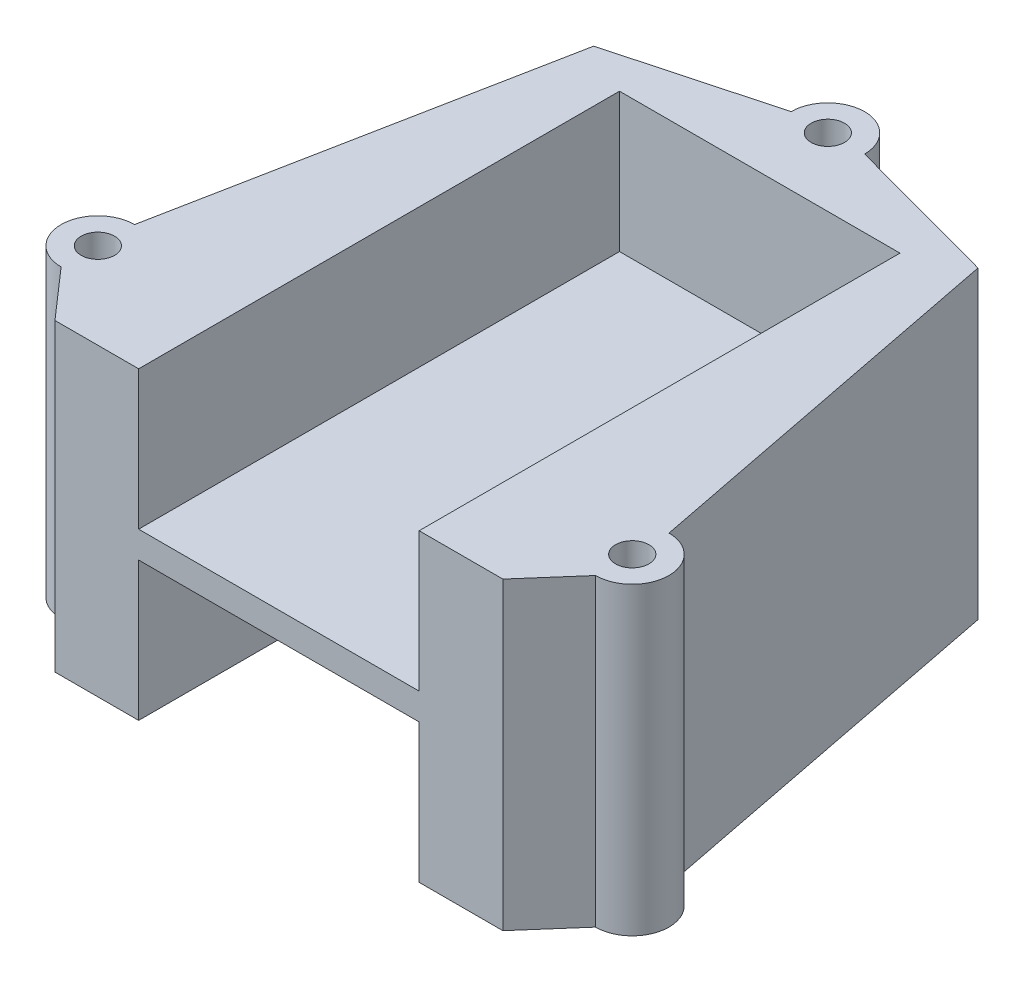
ISO-10303-21;
HEADER;
FILE_DESCRIPTION(('STEP AP214'),'2;1');
FILE_NAME('part.step','',(''),(''),'','','');
FILE_SCHEMA(('AUTOMOTIVE_DESIGN { 1 0 10303 214 1 1 1 1 }'));
ENDSEC;
DATA;
#1=APPLICATION_CONTEXT('core data for automotive mechanical design processes');
#2=APPLICATION_PROTOCOL_DEFINITION('international standard','automotive_design',2000,#1);
#3=PRODUCT_CONTEXT('',#1,'mechanical');
#4=PRODUCT('Part','Part','',(#3));
#5=PRODUCT_RELATED_PRODUCT_CATEGORY('part','',(#4));
#6=PRODUCT_DEFINITION_FORMATION('','',#4);
#7=PRODUCT_DEFINITION_CONTEXT('part definition',#1,'design');
#8=PRODUCT_DEFINITION('design','',#6,#7);
#9=PRODUCT_DEFINITION_SHAPE('','',#8);
#10=(LENGTH_UNIT() NAMED_UNIT(*) SI_UNIT(.MILLI.,.METRE.));
#11=(NAMED_UNIT(*) PLANE_ANGLE_UNIT() SI_UNIT($,.RADIAN.));
#12=(NAMED_UNIT(*) SI_UNIT($,.STERADIAN.) SOLID_ANGLE_UNIT());
#13=UNCERTAINTY_MEASURE_WITH_UNIT(LENGTH_MEASURE(1.E-05),#10,'distance_accuracy_value','');
#14=(GEOMETRIC_REPRESENTATION_CONTEXT(3) GLOBAL_UNCERTAINTY_ASSIGNED_CONTEXT((#13)) GLOBAL_UNIT_ASSIGNED_CONTEXT((#10,
#11,#12)) REPRESENTATION_CONTEXT('',''));
#15=CARTESIAN_POINT('',(0.,0.,0.));
#16=DIRECTION('',(0.,0.,1.));
#17=DIRECTION('',(1.,0.,0.));
#18=AXIS2_PLACEMENT_3D('',#15,#16,#17);
#19=CARTESIAN_POINT('',(7.62756429182967,31.496,-28.2193089615794));
#20=DIRECTION('',(-0.260932107471473,0.,0.965357154264936));
#21=DIRECTION('',(0.965357154264936,0.,0.260932107471473));
#22=AXIS2_PLACEMENT_3D('',#19,#20,#21);
#23=PLANE('',#22);
#24=DIRECTION('',(-0.965357154264936,0.,-0.260932107471473));
#25=VECTOR('',#24,1.);
#26=CARTESIAN_POINT('',(7.62756429182967,2.54,-28.2193089615794));
#27=LINE('',#26,#25);
#28=CARTESIAN_POINT('',(18.2707496641315,2.54,-25.342499298819));
#29=VERTEX_POINT('',#28);
#30=CARTESIAN_POINT('',(3.4925,2.54,-29.337));
#31=VERTEX_POINT('',#30);
#32=EDGE_CURVE('E190',#29,#31,#27,.T.);
#33=ORIENTED_EDGE('',*,*,#32,.T.);
#34=DIRECTION('',(0.,-1.,0.));
#35=VECTOR('',#34,1.);
#36=CARTESIAN_POINT('',(3.4925,31.496,-29.337));
#37=LINE('',#36,#35);
#38=CARTESIAN_POINT('',(3.4925,31.496,-29.337));
#39=VERTEX_POINT('',#38);
#40=EDGE_CURVE('E303',#39,#31,#37,.T.);
#41=ORIENTED_EDGE('',*,*,#40,.F.);
#42=DIRECTION('',(-0.965357154264936,0.,-0.260932107471473));
#43=VECTOR('',#42,1.);
#44=CARTESIAN_POINT('',(7.62756429182967,31.496,-28.2193089615794));
#45=LINE('',#44,#43);
#46=CARTESIAN_POINT('',(18.2707496641315,31.496,-25.342499298819));
#47=VERTEX_POINT('',#46);
#48=EDGE_CURVE('E208',#47,#39,#45,.T.);
#49=ORIENTED_EDGE('',*,*,#48,.F.);
#50=DIRECTION('',(0.,-1.,0.));
#51=VECTOR('',#50,1.);
#52=CARTESIAN_POINT('',(18.2707496641315,31.496,-25.342499298819));
#53=LINE('',#52,#51);
#54=EDGE_CURVE('E246',#47,#29,#53,.T.);
#55=ORIENTED_EDGE('',*,*,#54,.T.);
#56=EDGE_LOOP('',(#33,#41,#49,#55));
#57=FACE_BOUND('',#56,.T.);
#58=ADVANCED_FACE('F37',(#57),#23,.F.);
#59=CARTESIAN_POINT('',(0.,31.496,-29.337));
#60=DIRECTION('',(0.,-1.,0.));
#61=DIRECTION('',(0.,0.,-1.));
#62=AXIS2_PLACEMENT_3D('',#59,#60,#61);
#63=CYLINDRICAL_SURFACE('',#62,3.4925);
#64=CARTESIAN_POINT('',(0.,2.54,-29.337));
#65=DIRECTION('',(0.,1.,0.));
#66=DIRECTION('',(0.,0.,1.));
#67=AXIS2_PLACEMENT_3D('',#64,#65,#66);
#68=CIRCLE('',#67,3.4925);
#69=CARTESIAN_POINT('',(-3.4925,2.54,-29.337));
#70=VERTEX_POINT('',#69);
#71=EDGE_CURVE('E249',#31,#70,#68,.T.);
#72=ORIENTED_EDGE('',*,*,#71,.T.);
#73=DIRECTION('',(0.,-1.,0.));
#74=VECTOR('',#73,1.);
#75=CARTESIAN_POINT('',(-3.4925,31.496,-29.337));
#76=LINE('',#75,#74);
#77=CARTESIAN_POINT('',(-3.4925,31.496,-29.337));
#78=VERTEX_POINT('',#77);
#79=EDGE_CURVE('E301',#78,#70,#76,.T.);
#80=ORIENTED_EDGE('',*,*,#79,.F.);
#81=CARTESIAN_POINT('',(0.,31.496,-29.337));
#82=DIRECTION('',(0.,1.,0.));
#83=DIRECTION('',(0.,0.,1.));
#84=AXIS2_PLACEMENT_3D('',#81,#82,#83);
#85=CIRCLE('',#84,3.4925);
#86=EDGE_CURVE('E211',#39,#78,#85,.T.);
#87=ORIENTED_EDGE('',*,*,#86,.F.);
#88=ORIENTED_EDGE('',*,*,#40,.T.);
#89=EDGE_LOOP('',(#72,#80,#87,#88));
#90=FACE_BOUND('',#89,.T.);
#91=ADVANCED_FACE('F368',(#90),#63,.T.);
#92=CARTESIAN_POINT('',(-7.62756429182967,31.496,-28.2193089615794));
#93=DIRECTION('',(-0.260932107471473,0.,-0.965357154264936));
#94=DIRECTION('',(-0.965357154264936,0.,0.260932107471473));
#95=AXIS2_PLACEMENT_3D('',#92,#93,#94);
#96=PLANE('',#95);
#97=DIRECTION('',(0.965357154264936,0.,-0.260932107471473));
#98=VECTOR('',#97,1.);
#99=CARTESIAN_POINT('',(-7.62756429182967,2.54,-28.2193089615794));
#100=LINE('',#99,#98);
#101=CARTESIAN_POINT('',(-18.2707496641315,2.54,-25.342499298819));
#102=VERTEX_POINT('',#101);
#103=EDGE_CURVE('E252',#102,#70,#100,.T.);
#104=ORIENTED_EDGE('',*,*,#103,.F.);
#105=DIRECTION('',(0.,-1.,0.));
#106=VECTOR('',#105,1.);
#107=CARTESIAN_POINT('',(-18.2707496641315,31.496,-25.342499298819));
#108=LINE('',#107,#106);
#109=CARTESIAN_POINT('',(-18.2707496641315,31.496,-25.342499298819));
#110=VERTEX_POINT('',#109);
#111=EDGE_CURVE('E299',#110,#102,#108,.T.);
#112=ORIENTED_EDGE('',*,*,#111,.F.);
#113=DIRECTION('',(0.965357154264936,0.,-0.260932107471473));
#114=VECTOR('',#113,1.);
#115=CARTESIAN_POINT('',(-7.62756429182967,31.496,-28.2193089615794));
#116=LINE('',#115,#114);
#117=EDGE_CURVE('E214',#110,#78,#116,.T.);
#118=ORIENTED_EDGE('',*,*,#117,.T.);
#119=ORIENTED_EDGE('',*,*,#79,.T.);
#120=EDGE_LOOP('',(#104,#112,#118,#119));
#121=FACE_BOUND('',#120,.T.);
#122=ADVANCED_FACE('F373',(#121),#96,.T.);
#123=CARTESIAN_POINT('',(-22.368668171537,31.496,-4.37091300614584));
#124=DIRECTION('',(-0.981438641880801,0.,-0.191776412061467));
#125=DIRECTION('',(-0.191776412061467,0.,0.981438641880801));
#126=AXIS2_PLACEMENT_3D('',#123,#124,#125);
#127=PLANE('',#126);
#128=DIRECTION('',(0.191776412061467,0.,-0.981438641880801));
#129=VECTOR('',#128,1.);
#130=CARTESIAN_POINT('',(-22.368668171537,2.54,-4.37091300614584));
#131=LINE('',#130,#129);
#132=CARTESIAN_POINT('',(-25.4065872708259,2.54,11.1759999999973));
#133=VERTEX_POINT('',#132);
#134=EDGE_CURVE('E255',#133,#102,#131,.T.);
#135=ORIENTED_EDGE('',*,*,#134,.F.);
#136=DIRECTION('',(0.,-1.,0.));
#137=VECTOR('',#136,1.);
#138=CARTESIAN_POINT('',(-25.4065872708259,31.496,11.1759999999973));
#139=LINE('',#138,#137);
#140=CARTESIAN_POINT('',(-25.4065872708259,31.496,11.1759999999973));
#141=VERTEX_POINT('',#140);
#142=EDGE_CURVE('E297',#141,#133,#139,.T.);
#143=ORIENTED_EDGE('',*,*,#142,.F.);
#144=DIRECTION('',(0.191776412061467,0.,-0.981438641880801));
#145=VECTOR('',#144,1.);
#146=CARTESIAN_POINT('',(-22.368668171537,31.496,-4.37091300614584));
#147=LINE('',#146,#145);
#148=EDGE_CURVE('E217',#141,#110,#147,.T.);
#149=ORIENTED_EDGE('',*,*,#148,.T.);
#150=ORIENTED_EDGE('',*,*,#111,.T.);
#151=EDGE_LOOP('',(#135,#143,#149,#150));
#152=FACE_BOUND('',#151,.T.);
#153=ADVANCED_FACE('F409',(#152),#127,.T.);
#154=CARTESIAN_POINT('',(-25.4065872708259,31.496,14.6684999999989));
#155=DIRECTION('',(0.,-1.,0.));
#156=DIRECTION('',(0.,0.,-1.));
#157=AXIS2_PLACEMENT_3D('',#154,#155,#156);
#158=CYLINDRICAL_SURFACE('',#157,3.49250000000161);
#159=CARTESIAN_POINT('',(-25.4065872708259,2.54,14.6684999999989));
#160=DIRECTION('',(0.,1.,0.));
#161=DIRECTION('',(0.,0.,1.));
#162=AXIS2_PLACEMENT_3D('',#159,#160,#161);
#163=CIRCLE('',#162,3.49250000000161);
#164=CARTESIAN_POINT('',(-25.406587270826,2.54,18.1610000000005));
#165=VERTEX_POINT('',#164);
#166=EDGE_CURVE('E258',#165,#133,#163,.F.);
#167=ORIENTED_EDGE('',*,*,#166,.F.);
#168=DIRECTION('',(0.,-1.,0.));
#169=VECTOR('',#168,1.);
#170=CARTESIAN_POINT('',(-25.406587270826,31.496,18.1610000000005));
#171=LINE('',#170,#169);
#172=CARTESIAN_POINT('',(-25.406587270826,31.496,18.1610000000005));
#173=VERTEX_POINT('',#172);
#174=EDGE_CURVE('E295',#173,#165,#171,.T.);
#175=ORIENTED_EDGE('',*,*,#174,.F.);
#176=CARTESIAN_POINT('',(-25.4065872708259,31.496,14.6684999999989));
#177=DIRECTION('',(0.,1.,0.));
#178=DIRECTION('',(0.,0.,1.));
#179=AXIS2_PLACEMENT_3D('',#176,#177,#178);
#180=CIRCLE('',#179,3.49250000000161);
#181=EDGE_CURVE('E220',#173,#141,#180,.F.);
#182=ORIENTED_EDGE('',*,*,#181,.T.);
#183=ORIENTED_EDGE('',*,*,#142,.T.);
#184=EDGE_LOOP('',(#167,#175,#182,#183));
#185=FACE_BOUND('',#184,.T.);
#186=ADVANCED_FACE('F406',(#185),#158,.T.);
#187=CARTESIAN_POINT('',(-23.3901994162581,31.496,20.4655425677233));
#188=DIRECTION('',(0.752590757097938,0.,-0.658488536218173));
#189=DIRECTION('',(-0.658488536218173,0.,-0.752590757097938));
#190=AXIS2_PLACEMENT_3D('',#187,#188,#189);
#191=PLANE('',#190);
#192=DIRECTION('',(0.658488536218173,0.,0.752590757097938));
#193=VECTOR('',#192,1.);
#194=CARTESIAN_POINT('',(-23.3901994162581,2.54,20.4655425677233));
#195=LINE('',#194,#193);
#196=CARTESIAN_POINT('',(-21.2951394454227,2.54,22.86));
#197=VERTEX_POINT('',#196);
#198=EDGE_CURVE('E261',#165,#197,#195,.T.);
#199=ORIENTED_EDGE('',*,*,#198,.T.);
#200=DIRECTION('',(0.,-1.,0.));
#201=VECTOR('',#200,1.);
#202=CARTESIAN_POINT('',(-21.2951394454227,31.496,22.86));
#203=LINE('',#202,#201);
#204=CARTESIAN_POINT('',(-21.2951394454227,31.496,22.86));
#205=VERTEX_POINT('',#204);
#206=EDGE_CURVE('E292',#205,#197,#203,.T.);
#207=ORIENTED_EDGE('',*,*,#206,.F.);
#208=DIRECTION('',(0.658488536218173,0.,0.752590757097938));
#209=VECTOR('',#208,1.);
#210=CARTESIAN_POINT('',(-23.3901994162581,31.496,20.4655425677233));
#211=LINE('',#210,#209);
#212=EDGE_CURVE('E223',#173,#205,#211,.T.);
#213=ORIENTED_EDGE('',*,*,#212,.F.);
#214=ORIENTED_EDGE('',*,*,#174,.T.);
#215=EDGE_LOOP('',(#199,#207,#213,#214));
#216=FACE_BOUND('',#215,.T.);
#217=ADVANCED_FACE('F328',(#216),#191,.F.);
#218=CARTESIAN_POINT('',(0.,31.496,22.86));
#219=DIRECTION('',(0.,0.,1.));
#220=DIRECTION('',(1.,0.,0.));
#221=AXIS2_PLACEMENT_3D('',#218,#219,#220);
#222=PLANE('',#221);
#223=DIRECTION('',(0.,1.,0.));
#224=VECTOR('',#223,1.);
#225=CARTESIAN_POINT('',(13.335,36.068,22.86));
#226=LINE('',#225,#224);
#227=CARTESIAN_POINT('',(13.335,18.288,22.86));
#228=VERTEX_POINT('',#227);
#229=CARTESIAN_POINT('',(13.335,31.496,22.86));
#230=VERTEX_POINT('',#229);
#231=EDGE_CURVE('E184',#228,#230,#226,.T.);
#232=ORIENTED_EDGE('',*,*,#231,.F.);
#233=DIRECTION('',(1.,0.,0.));
#234=VECTOR('',#233,1.);
#235=CARTESIAN_POINT('',(13.335,18.288,22.86));
#236=LINE('',#235,#234);
#237=CARTESIAN_POINT('',(-13.335,18.288,22.86));
#238=VERTEX_POINT('',#237);
#239=EDGE_CURVE('E188',#238,#228,#236,.T.);
#240=ORIENTED_EDGE('',*,*,#239,.F.);
#241=DIRECTION('',(0.,-1.,0.));
#242=VECTOR('',#241,1.);
#243=CARTESIAN_POINT('',(-13.335,36.068,22.86));
#244=LINE('',#243,#242);
#245=CARTESIAN_POINT('',(-13.335,31.496,22.86));
#246=VERTEX_POINT('',#245);
#247=EDGE_CURVE('E174',#246,#238,#244,.T.);
#248=ORIENTED_EDGE('',*,*,#247,.F.);
#249=DIRECTION('',(-1.,0.,0.));
#250=VECTOR('',#249,1.);
#251=CARTESIAN_POINT('',(0.,31.496,22.86));
#252=LINE('',#251,#250);
#253=EDGE_CURVE('E226',#246,#205,#252,.T.);
#254=ORIENTED_EDGE('',*,*,#253,.T.);
#255=ORIENTED_EDGE('',*,*,#206,.T.);
#256=DIRECTION('',(-1.,0.,0.));
#257=VECTOR('',#256,1.);
#258=CARTESIAN_POINT('',(0.,2.54,22.86));
#259=LINE('',#258,#257);
#260=CARTESIAN_POINT('',(-13.335,2.54,22.86));
#261=VERTEX_POINT('',#260);
#262=EDGE_CURVE('E264',#261,#197,#259,.T.);
#263=ORIENTED_EDGE('',*,*,#262,.F.);
#264=DIRECTION('',(0.,-1.,0.));
#265=VECTOR('',#264,1.);
#266=CARTESIAN_POINT('',(-13.335,-2.032,22.86));
#267=LINE('',#266,#265);
#268=CARTESIAN_POINT('',(-13.335,15.748,22.86));
#269=VERTEX_POINT('',#268);
#270=EDGE_CURVE('E195',#269,#261,#267,.T.);
#271=ORIENTED_EDGE('',*,*,#270,.F.);
#272=DIRECTION('',(-1.,0.,0.));
#273=VECTOR('',#272,1.);
#274=CARTESIAN_POINT('',(13.335,15.748,22.86));
#275=LINE('',#274,#273);
#276=CARTESIAN_POINT('',(13.335,15.748,22.86));
#277=VERTEX_POINT('',#276);
#278=EDGE_CURVE('E201',#277,#269,#275,.T.);
#279=ORIENTED_EDGE('',*,*,#278,.F.);
#280=DIRECTION('',(0.,1.,0.));
#281=VECTOR('',#280,1.);
#282=CARTESIAN_POINT('',(13.335,-2.032,22.86));
#283=LINE('',#282,#281);
#284=CARTESIAN_POINT('',(13.335,2.54,22.86));
#285=VERTEX_POINT('',#284);
#286=EDGE_CURVE('E199',#285,#277,#283,.T.);
#287=ORIENTED_EDGE('',*,*,#286,.F.);
#288=CARTESIAN_POINT('',(21.2951394454227,2.54,22.86));
#289=VERTEX_POINT('',#288);
#290=EDGE_CURVE('E265',#289,#285,#259,.T.);
#291=ORIENTED_EDGE('',*,*,#290,.F.);
#292=DIRECTION('',(0.,-1.,0.));
#293=VECTOR('',#292,1.);
#294=CARTESIAN_POINT('',(21.2951394454227,31.496,22.86));
#295=LINE('',#294,#293);
#296=CARTESIAN_POINT('',(21.2951394454227,31.496,22.86));
#297=VERTEX_POINT('',#296);
#298=EDGE_CURVE('E290',#297,#289,#295,.T.);
#299=ORIENTED_EDGE('',*,*,#298,.F.);
#300=EDGE_CURVE('E227',#297,#230,#252,.T.);
#301=ORIENTED_EDGE('',*,*,#300,.T.);
#302=EDGE_LOOP('',(#232,#240,#248,#254,#255,#263,#271,#279,#287,#291,#299,#301));
#303=FACE_BOUND('',#302,.T.);
#304=ADVANCED_FACE('F319',(#303),#222,.T.);
#305=CARTESIAN_POINT('',(23.3901994162581,31.496,20.4655425677234));
#306=DIRECTION('',(0.752590757097937,0.,0.658488536218175));
#307=DIRECTION('',(0.658488536218175,0.,-0.752590757097937));
#308=AXIS2_PLACEMENT_3D('',#305,#306,#307);
#309=PLANE('',#308);
#310=DIRECTION('',(-0.658488536218175,0.,0.752590757097937));
#311=VECTOR('',#310,1.);
#312=CARTESIAN_POINT('',(23.3901994162581,2.54,20.4655425677234));
#313=LINE('',#312,#311);
#314=CARTESIAN_POINT('',(25.4065872708259,2.54,18.1610000000005));
#315=VERTEX_POINT('',#314);
#316=EDGE_CURVE('E268',#315,#289,#313,.T.);
#317=ORIENTED_EDGE('',*,*,#316,.F.);
#318=DIRECTION('',(0.,-1.,0.));
#319=VECTOR('',#318,1.);
#320=CARTESIAN_POINT('',(25.4065872708259,31.496,18.1610000000005));
#321=LINE('',#320,#319);
#322=CARTESIAN_POINT('',(25.4065872708259,31.496,18.1610000000005));
#323=VERTEX_POINT('',#322);
#324=EDGE_CURVE('E288',#323,#315,#321,.T.);
#325=ORIENTED_EDGE('',*,*,#324,.F.);
#326=DIRECTION('',(-0.658488536218175,0.,0.752590757097937));
#327=VECTOR('',#326,1.);
#328=CARTESIAN_POINT('',(23.3901994162581,31.496,20.4655425677234));
#329=LINE('',#328,#327);
#330=EDGE_CURVE('E230',#323,#297,#329,.T.);
#331=ORIENTED_EDGE('',*,*,#330,.T.);
#332=ORIENTED_EDGE('',*,*,#298,.T.);
#333=EDGE_LOOP('',(#317,#325,#331,#332));
#334=FACE_BOUND('',#333,.T.);
#335=ADVANCED_FACE('F350',(#334),#309,.T.);
#336=CARTESIAN_POINT('',(25.4065872708259,31.496,14.6684999999989));
#337=DIRECTION('',(0.,-1.,0.));
#338=DIRECTION('',(0.,0.,-1.));
#339=AXIS2_PLACEMENT_3D('',#336,#337,#338);
#340=CYLINDRICAL_SURFACE('',#339,3.49250000000161);
#341=CARTESIAN_POINT('',(25.4065872708259,2.54,14.6684999999989));
#342=DIRECTION('',(0.,1.,0.));
#343=DIRECTION('',(0.,0.,1.));
#344=AXIS2_PLACEMENT_3D('',#341,#342,#343);
#345=CIRCLE('',#344,3.49250000000161);
#346=CARTESIAN_POINT('',(25.4065872708259,2.54,11.1759999999973));
#347=VERTEX_POINT('',#346);
#348=EDGE_CURVE('E271',#315,#347,#345,.T.);
#349=ORIENTED_EDGE('',*,*,#348,.T.);
#350=DIRECTION('',(0.,-1.,0.));
#351=VECTOR('',#350,1.);
#352=CARTESIAN_POINT('',(25.4065872708259,31.496,11.1759999999973));
#353=LINE('',#352,#351);
#354=CARTESIAN_POINT('',(25.4065872708259,31.496,11.1759999999973));
#355=VERTEX_POINT('',#354);
#356=EDGE_CURVE('E285',#355,#347,#353,.T.);
#357=ORIENTED_EDGE('',*,*,#356,.F.);
#358=CARTESIAN_POINT('',(25.4065872708259,31.496,14.6684999999989));
#359=DIRECTION('',(0.,1.,0.));
#360=DIRECTION('',(0.,0.,1.));
#361=AXIS2_PLACEMENT_3D('',#358,#359,#360);
#362=CIRCLE('',#361,3.49250000000161);
#363=EDGE_CURVE('E233',#323,#355,#362,.T.);
#364=ORIENTED_EDGE('',*,*,#363,.F.);
#365=ORIENTED_EDGE('',*,*,#324,.T.);
#366=EDGE_LOOP('',(#349,#357,#364,#365));
#367=FACE_BOUND('',#366,.T.);
#368=ADVANCED_FACE('F387',(#367),#340,.T.);
#369=CARTESIAN_POINT('',(-25.4065872708222,31.496,14.6685000000011));
#370=DIRECTION('',(0.,-1.,0.));
#371=DIRECTION('',(0.,0.,-1.));
#372=AXIS2_PLACEMENT_3D('',#369,#370,#371);
#373=CYLINDRICAL_SURFACE('',#372,1.58750000000238);
#374=CARTESIAN_POINT('',(-25.4065872708222,31.496,14.6685000000011));
#375=DIRECTION('',(0.,1.,0.));
#376=DIRECTION('',(0.,0.,1.));
#377=AXIS2_PLACEMENT_3D('',#374,#375,#376);
#378=CIRCLE('',#377,1.58750000000238);
#379=CARTESIAN_POINT('',(-25.4065872708222,31.496,16.2560000000035));
#380=VERTEX_POINT('',#379);
#381=EDGE_CURVE('E240',#380,#380,#378,.F.);
#382=ORIENTED_EDGE('',*,*,#381,.F.);
#383=EDGE_LOOP('',(#382));
#384=FACE_BOUND('',#383,.T.);
#385=CARTESIAN_POINT('',(-25.4065872708222,2.54,14.6685000000011));
#386=DIRECTION('',(0.,1.,0.));
#387=DIRECTION('',(0.,0.,1.));
#388=AXIS2_PLACEMENT_3D('',#385,#386,#387);
#389=CIRCLE('',#388,1.58750000000238);
#390=CARTESIAN_POINT('',(-25.4065872708222,2.54,16.2560000000035));
#391=VERTEX_POINT('',#390);
#392=EDGE_CURVE('E278',#391,#391,#389,.F.);
#393=ORIENTED_EDGE('',*,*,#392,.T.);
#394=EDGE_LOOP('',(#393));
#395=FACE_BOUND('',#394,.T.);
#396=ADVANCED_FACE('F389',(#384,#395),#373,.F.);
#397=CARTESIAN_POINT('',(25.4065872708259,31.496,14.6684999999989));
#398=DIRECTION('',(0.,-1.,0.));
#399=DIRECTION('',(0.,0.,-1.));
#400=AXIS2_PLACEMENT_3D('',#397,#398,#399);
#401=CYLINDRICAL_SURFACE('',#400,1.58750000000161);
#402=CARTESIAN_POINT('',(25.4065872708259,31.496,14.6684999999989));
#403=DIRECTION('',(0.,1.,0.));
#404=DIRECTION('',(0.,0.,1.));
#405=AXIS2_PLACEMENT_3D('',#402,#403,#404);
#406=CIRCLE('',#405,1.58750000000161);
#407=CARTESIAN_POINT('',(25.4065872708259,31.496,16.2560000000005));
#408=VERTEX_POINT('',#407);
#409=EDGE_CURVE('E237',#408,#408,#406,.F.);
#410=ORIENTED_EDGE('',*,*,#409,.F.);
#411=EDGE_LOOP('',(#410));
#412=FACE_BOUND('',#411,.T.);
#413=CARTESIAN_POINT('',(25.4065872708259,2.54,14.6684999999989));
#414=DIRECTION('',(0.,1.,0.));
#415=DIRECTION('',(0.,0.,1.));
#416=AXIS2_PLACEMENT_3D('',#413,#414,#415);
#417=CIRCLE('',#416,1.58750000000161);
#418=CARTESIAN_POINT('',(25.4065872708259,2.54,16.2560000000005));
#419=VERTEX_POINT('',#418);
#420=EDGE_CURVE('E275',#419,#419,#417,.F.);
#421=ORIENTED_EDGE('',*,*,#420,.T.);
#422=EDGE_LOOP('',(#421));
#423=FACE_BOUND('',#422,.T.);
#424=ADVANCED_FACE('F395',(#412,#423),#401,.F.);
#425=CARTESIAN_POINT('',(22.368668171537,31.496,-4.37091300614584));
#426=DIRECTION('',(-0.981438641880801,0.,0.191776412061467));
#427=DIRECTION('',(0.191776412061467,0.,0.981438641880801));
#428=AXIS2_PLACEMENT_3D('',#425,#426,#427);
#429=PLANE('',#428);
#430=DIRECTION('',(-0.191776412061467,0.,-0.981438641880801));
#431=VECTOR('',#430,1.);
#432=CARTESIAN_POINT('',(22.368668171537,2.54,-4.37091300614584));
#433=LINE('',#432,#431);
#434=EDGE_CURVE('E273',#347,#29,#433,.T.);
#435=ORIENTED_EDGE('',*,*,#434,.T.);
#436=ORIENTED_EDGE('',*,*,#54,.F.);
#437=DIRECTION('',(-0.191776412061467,0.,-0.981438641880801));
#438=VECTOR('',#437,1.);
#439=CARTESIAN_POINT('',(22.368668171537,31.496,-4.37091300614584));
#440=LINE('',#439,#438);
#441=EDGE_CURVE('E235',#355,#47,#440,.T.);
#442=ORIENTED_EDGE('',*,*,#441,.F.);
#443=ORIENTED_EDGE('',*,*,#356,.T.);
#444=EDGE_LOOP('',(#435,#436,#442,#443));
#445=FACE_BOUND('',#444,.T.);
#446=ADVANCED_FACE('F385',(#445),#429,.F.);
#447=CARTESIAN_POINT('',(0.,31.496,-29.337));
#448=DIRECTION('',(0.,-1.,0.));
#449=DIRECTION('',(0.,0.,-1.));
#450=AXIS2_PLACEMENT_3D('',#447,#448,#449);
#451=CYLINDRICAL_SURFACE('',#450,1.5875);
#452=CARTESIAN_POINT('',(0.,31.496,-29.337));
#453=DIRECTION('',(0.,1.,0.));
#454=DIRECTION('',(0.,0.,1.));
#455=AXIS2_PLACEMENT_3D('',#452,#453,#454);
#456=CIRCLE('',#455,1.5875);
#457=CARTESIAN_POINT('',(0.,31.496,-27.7495));
#458=VERTEX_POINT('',#457);
#459=EDGE_CURVE('E243',#458,#458,#456,.F.);
#460=ORIENTED_EDGE('',*,*,#459,.F.);
#461=EDGE_LOOP('',(#460));
#462=FACE_BOUND('',#461,.T.);
#463=CARTESIAN_POINT('',(0.,2.54,-29.337));
#464=DIRECTION('',(0.,1.,0.));
#465=DIRECTION('',(0.,0.,1.));
#466=AXIS2_PLACEMENT_3D('',#463,#464,#465);
#467=CIRCLE('',#466,1.5875);
#468=CARTESIAN_POINT('',(0.,2.54,-27.7495));
#469=VERTEX_POINT('',#468);
#470=EDGE_CURVE('E212',#469,#469,#467,.F.);
#471=ORIENTED_EDGE('',*,*,#470,.T.);
#472=EDGE_LOOP('',(#471));
#473=FACE_BOUND('',#472,.T.);
#474=ADVANCED_FACE('F469',(#462,#473),#451,.F.);
#475=CARTESIAN_POINT('',(0.,31.496,0.));
#476=DIRECTION('',(0.,1.,0.));
#477=DIRECTION('',(0.,0.,1.));
#478=AXIS2_PLACEMENT_3D('',#475,#476,#477);
#479=PLANE('',#478);
#480=DIRECTION('',(0.,0.,-1.));
#481=VECTOR('',#480,1.);
#482=CARTESIAN_POINT('',(13.335,31.496,0.));
#483=LINE('',#482,#481);
#484=CARTESIAN_POINT('',(13.335,31.496,-22.86));
#485=VERTEX_POINT('',#484);
#486=EDGE_CURVE('E11',#230,#485,#483,.T.);
#487=ORIENTED_EDGE('',*,*,#486,.F.);
#488=ORIENTED_EDGE('',*,*,#300,.F.);
#489=ORIENTED_EDGE('',*,*,#330,.F.);
#490=ORIENTED_EDGE('',*,*,#363,.T.);
#491=ORIENTED_EDGE('',*,*,#441,.T.);
#492=ORIENTED_EDGE('',*,*,#48,.T.);
#493=ORIENTED_EDGE('',*,*,#86,.T.);
#494=ORIENTED_EDGE('',*,*,#117,.F.);
#495=ORIENTED_EDGE('',*,*,#148,.F.);
#496=ORIENTED_EDGE('',*,*,#181,.F.);
#497=ORIENTED_EDGE('',*,*,#212,.T.);
#498=ORIENTED_EDGE('',*,*,#253,.F.);
#499=DIRECTION('',(0.,0.,1.));
#500=VECTOR('',#499,1.);
#501=CARTESIAN_POINT('',(-13.335,31.496,0.));
#502=LINE('',#501,#500);
#503=CARTESIAN_POINT('',(-13.335,31.496,-22.86));
#504=VERTEX_POINT('',#503);
#505=EDGE_CURVE('E44',#504,#246,#502,.T.);
#506=ORIENTED_EDGE('',*,*,#505,.F.);
#507=DIRECTION('',(-1.,0.,0.));
#508=VECTOR('',#507,1.);
#509=CARTESIAN_POINT('',(0.,31.496,-22.86));
#510=LINE('',#509,#508);
#511=EDGE_CURVE('E166',#485,#504,#510,.T.);
#512=ORIENTED_EDGE('',*,*,#511,.F.);
#513=EDGE_LOOP('',(#487,#488,#489,#490,#491,#492,#493,#494,#495,#496,#497,#498,#506,#512));
#514=FACE_BOUND('',#513,.T.);
#515=ORIENTED_EDGE('',*,*,#409,.T.);
#516=EDGE_LOOP('',(#515));
#517=FACE_BOUND('',#516,.T.);
#518=ORIENTED_EDGE('',*,*,#381,.T.);
#519=EDGE_LOOP('',(#518));
#520=FACE_BOUND('',#519,.T.);
#521=ORIENTED_EDGE('',*,*,#459,.T.);
#522=EDGE_LOOP('',(#521));
#523=FACE_BOUND('',#522,.T.);
#524=ADVANCED_FACE('F321',(#514,#517,#520,#523),#479,.T.);
#525=CARTESIAN_POINT('',(0.,2.54,0.));
#526=DIRECTION('',(0.,1.,0.));
#527=DIRECTION('',(0.,0.,1.));
#528=AXIS2_PLACEMENT_3D('',#525,#526,#527);
#529=PLANE('',#528);
#530=DIRECTION('',(-1.,0.,0.));
#531=VECTOR('',#530,1.);
#532=CARTESIAN_POINT('',(0.,2.54,-22.86));
#533=LINE('',#532,#531);
#534=CARTESIAN_POINT('',(13.335,2.54,-22.86));
#535=VERTEX_POINT('',#534);
#536=CARTESIAN_POINT('',(-13.335,2.54,-22.86));
#537=VERTEX_POINT('',#536);
#538=EDGE_CURVE('E306',#535,#537,#533,.T.);
#539=ORIENTED_EDGE('',*,*,#538,.T.);
#540=DIRECTION('',(0.,0.,1.));
#541=VECTOR('',#540,1.);
#542=CARTESIAN_POINT('',(-13.335,2.54,0.));
#543=LINE('',#542,#541);
#544=EDGE_CURVE('E312',#537,#261,#543,.T.);
#545=ORIENTED_EDGE('',*,*,#544,.T.);
#546=ORIENTED_EDGE('',*,*,#262,.T.);
#547=ORIENTED_EDGE('',*,*,#198,.F.);
#548=ORIENTED_EDGE('',*,*,#166,.T.);
#549=ORIENTED_EDGE('',*,*,#134,.T.);
#550=ORIENTED_EDGE('',*,*,#103,.T.);
#551=ORIENTED_EDGE('',*,*,#71,.F.);
#552=ORIENTED_EDGE('',*,*,#32,.F.);
#553=ORIENTED_EDGE('',*,*,#434,.F.);
#554=ORIENTED_EDGE('',*,*,#348,.F.);
#555=ORIENTED_EDGE('',*,*,#316,.T.);
#556=ORIENTED_EDGE('',*,*,#290,.T.);
#557=DIRECTION('',(0.,0.,-1.));
#558=VECTOR('',#557,1.);
#559=CARTESIAN_POINT('',(13.335,2.54,0.));
#560=LINE('',#559,#558);
#561=EDGE_CURVE('E309',#285,#535,#560,.T.);
#562=ORIENTED_EDGE('',*,*,#561,.T.);
#563=EDGE_LOOP('',(#539,#545,#546,#547,#548,#549,#550,#551,#552,#553,#554,#555,#556,#562));
#564=FACE_BOUND('',#563,.T.);
#565=ORIENTED_EDGE('',*,*,#420,.F.);
#566=EDGE_LOOP('',(#565));
#567=FACE_BOUND('',#566,.T.);
#568=ORIENTED_EDGE('',*,*,#392,.F.);
#569=EDGE_LOOP('',(#568));
#570=FACE_BOUND('',#569,.T.);
#571=ORIENTED_EDGE('',*,*,#470,.F.);
#572=EDGE_LOOP('',(#571));
#573=FACE_BOUND('',#572,.T.);
#574=ADVANCED_FACE('F334',(#564,#567,#570,#573),#529,.F.);
#575=CARTESIAN_POINT('',(-13.335,-2.032,-22.86));
#576=DIRECTION('',(-1.,0.,0.));
#577=DIRECTION('',(0.,-1.,0.));
#578=AXIS2_PLACEMENT_3D('',#575,#576,#577);
#579=PLANE('',#578);
#580=DIRECTION('',(0.,-1.,0.));
#581=VECTOR('',#580,1.);
#582=CARTESIAN_POINT('',(-13.335,-2.032,-22.86));
#583=LINE('',#582,#581);
#584=CARTESIAN_POINT('',(-13.335,15.748,-22.86));
#585=VERTEX_POINT('',#584);
#586=EDGE_CURVE('E58',#585,#537,#583,.T.);
#587=ORIENTED_EDGE('',*,*,#586,.F.);
#588=DIRECTION('',(0.,0.,1.));
#589=VECTOR('',#588,1.);
#590=CARTESIAN_POINT('',(-13.335,15.748,-22.86));
#591=LINE('',#590,#589);
#592=EDGE_CURVE('E186',#585,#269,#591,.T.);
#593=ORIENTED_EDGE('',*,*,#592,.T.);
#594=ORIENTED_EDGE('',*,*,#270,.T.);
#595=ORIENTED_EDGE('',*,*,#544,.F.);
#596=EDGE_LOOP('',(#587,#593,#594,#595));
#597=FACE_BOUND('',#596,.T.);
#598=ADVANCED_FACE('F338',(#597),#579,.F.);
#599=CARTESIAN_POINT('',(13.335,-2.032,-22.86));
#600=DIRECTION('',(1.,0.,0.));
#601=DIRECTION('',(0.,1.,0.));
#602=AXIS2_PLACEMENT_3D('',#599,#600,#601);
#603=PLANE('',#602);
#604=ORIENTED_EDGE('',*,*,#286,.T.);
#605=DIRECTION('',(0.,0.,1.));
#606=VECTOR('',#605,1.);
#607=CARTESIAN_POINT('',(13.335,15.748,-22.86));
#608=LINE('',#607,#606);
#609=CARTESIAN_POINT('',(13.335,15.748,-22.86));
#610=VERTEX_POINT('',#609);
#611=EDGE_CURVE('E198',#610,#277,#608,.T.);
#612=ORIENTED_EDGE('',*,*,#611,.F.);
#613=DIRECTION('',(0.,1.,0.));
#614=VECTOR('',#613,1.);
#615=CARTESIAN_POINT('',(13.335,-2.032,-22.86));
#616=LINE('',#615,#614);
#617=EDGE_CURVE('E192',#535,#610,#616,.T.);
#618=ORIENTED_EDGE('',*,*,#617,.F.);
#619=ORIENTED_EDGE('',*,*,#561,.F.);
#620=EDGE_LOOP('',(#604,#612,#618,#619));
#621=FACE_BOUND('',#620,.T.);
#622=ADVANCED_FACE('F497',(#621),#603,.F.);
#623=CARTESIAN_POINT('',(0.,0.,-22.86));
#624=DIRECTION('',(0.,0.,-1.));
#625=DIRECTION('',(-1.,0.,0.));
#626=AXIS2_PLACEMENT_3D('',#623,#624,#625);
#627=PLANE('',#626);
#628=ORIENTED_EDGE('',*,*,#617,.T.);
#629=DIRECTION('',(-1.,0.,0.));
#630=VECTOR('',#629,1.);
#631=CARTESIAN_POINT('',(13.335,15.748,-22.86));
#632=LINE('',#631,#630);
#633=EDGE_CURVE('E194',#610,#585,#632,.T.);
#634=ORIENTED_EDGE('',*,*,#633,.T.);
#635=ORIENTED_EDGE('',*,*,#586,.T.);
#636=ORIENTED_EDGE('',*,*,#538,.F.);
#637=EDGE_LOOP('',(#628,#634,#635,#636));
#638=FACE_BOUND('',#637,.T.);
#639=ADVANCED_FACE('F363',(#638),#627,.F.);
#640=CARTESIAN_POINT('',(13.335,15.748,-22.86));
#641=DIRECTION('',(0.,1.,0.));
#642=DIRECTION('',(0.,0.,1.));
#643=AXIS2_PLACEMENT_3D('',#640,#641,#642);
#644=PLANE('',#643);
#645=ORIENTED_EDGE('',*,*,#278,.T.);
#646=ORIENTED_EDGE('',*,*,#592,.F.);
#647=ORIENTED_EDGE('',*,*,#633,.F.);
#648=ORIENTED_EDGE('',*,*,#611,.T.);
#649=EDGE_LOOP('',(#645,#646,#647,#648));
#650=FACE_BOUND('',#649,.T.);
#651=ADVANCED_FACE('F341',(#650),#644,.F.);
#652=CARTESIAN_POINT('',(13.335,36.068,-22.86));
#653=DIRECTION('',(1.,0.,0.));
#654=DIRECTION('',(0.,1.,0.));
#655=AXIS2_PLACEMENT_3D('',#652,#653,#654);
#656=PLANE('',#655);
#657=ORIENTED_EDGE('',*,*,#486,.T.);
#658=DIRECTION('',(0.,1.,0.));
#659=VECTOR('',#658,1.);
#660=CARTESIAN_POINT('',(13.335,36.068,-22.86));
#661=LINE('',#660,#659);
#662=CARTESIAN_POINT('',(13.335,18.288,-22.86));
#663=VERTEX_POINT('',#662);
#664=EDGE_CURVE('E51',#663,#485,#661,.T.);
#665=ORIENTED_EDGE('',*,*,#664,.F.);
#666=DIRECTION('',(0.,0.,1.));
#667=VECTOR('',#666,1.);
#668=CARTESIAN_POINT('',(13.335,18.288,-22.86));
#669=LINE('',#668,#667);
#670=EDGE_CURVE('E178',#663,#228,#669,.T.);
#671=ORIENTED_EDGE('',*,*,#670,.T.);
#672=ORIENTED_EDGE('',*,*,#231,.T.);
#673=EDGE_LOOP('',(#657,#665,#671,#672));
#674=FACE_BOUND('',#673,.T.);
#675=ADVANCED_FACE('F355',(#674),#656,.F.);
#676=CARTESIAN_POINT('',(13.335,18.288,-22.86));
#677=DIRECTION('',(0.,-1.,0.));
#678=DIRECTION('',(0.,0.,-1.));
#679=AXIS2_PLACEMENT_3D('',#676,#677,#678);
#680=PLANE('',#679);
#681=ORIENTED_EDGE('',*,*,#239,.T.);
#682=ORIENTED_EDGE('',*,*,#670,.F.);
#683=DIRECTION('',(1.,0.,0.));
#684=VECTOR('',#683,1.);
#685=CARTESIAN_POINT('',(13.335,18.288,-22.86));
#686=LINE('',#685,#684);
#687=CARTESIAN_POINT('',(-13.335,18.288,-22.86));
#688=VERTEX_POINT('',#687);
#689=EDGE_CURVE('E164',#688,#663,#686,.T.);
#690=ORIENTED_EDGE('',*,*,#689,.F.);
#691=DIRECTION('',(0.,0.,1.));
#692=VECTOR('',#691,1.);
#693=CARTESIAN_POINT('',(-13.335,18.288,-22.86));
#694=LINE('',#693,#692);
#695=EDGE_CURVE('E171',#688,#238,#694,.T.);
#696=ORIENTED_EDGE('',*,*,#695,.T.);
#697=EDGE_LOOP('',(#681,#682,#690,#696));
#698=FACE_BOUND('',#697,.T.);
#699=ADVANCED_FACE('F180',(#698),#680,.F.);
#700=CARTESIAN_POINT('',(-13.335,36.068,-22.86));
#701=DIRECTION('',(-1.,0.,0.));
#702=DIRECTION('',(0.,-1.,0.));
#703=AXIS2_PLACEMENT_3D('',#700,#701,#702);
#704=PLANE('',#703);
#705=ORIENTED_EDGE('',*,*,#505,.T.);
#706=ORIENTED_EDGE('',*,*,#247,.T.);
#707=ORIENTED_EDGE('',*,*,#695,.F.);
#708=DIRECTION('',(0.,-1.,0.));
#709=VECTOR('',#708,1.);
#710=CARTESIAN_POINT('',(-13.335,36.068,-22.86));
#711=LINE('',#710,#709);
#712=EDGE_CURVE('E160',#504,#688,#711,.T.);
#713=ORIENTED_EDGE('',*,*,#712,.F.);
#714=EDGE_LOOP('',(#705,#706,#707,#713));
#715=FACE_BOUND('',#714,.T.);
#716=ADVANCED_FACE('F172',(#715),#704,.F.);
#717=CARTESIAN_POINT('',(0.,0.,-22.86));
#718=DIRECTION('',(0.,0.,-1.));
#719=DIRECTION('',(-1.,0.,0.));
#720=AXIS2_PLACEMENT_3D('',#717,#718,#719);
#721=PLANE('',#720);
#722=ORIENTED_EDGE('',*,*,#511,.T.);
#723=ORIENTED_EDGE('',*,*,#712,.T.);
#724=ORIENTED_EDGE('',*,*,#689,.T.);
#725=ORIENTED_EDGE('',*,*,#664,.T.);
#726=EDGE_LOOP('',(#722,#723,#724,#725));
#727=FACE_BOUND('',#726,.T.);
#728=ADVANCED_FACE('F162',(#727),#721,.F.);
#729=CLOSED_SHELL('',(#58,#91,#122,#153,#186,#217,#304,#335,#368,#396,#424,#446,#474,#524,#574,
#598,#622,#639,#651,#675,#699,#716,#728));
#730=MANIFOLD_SOLID_BREP('B2',#729);
#731=ADVANCED_BREP_SHAPE_REPRESENTATION('',(#18,#730),#14);
#732=SHAPE_DEFINITION_REPRESENTATION(#9,#731);
ENDSEC;
END-ISO-10303-21;
